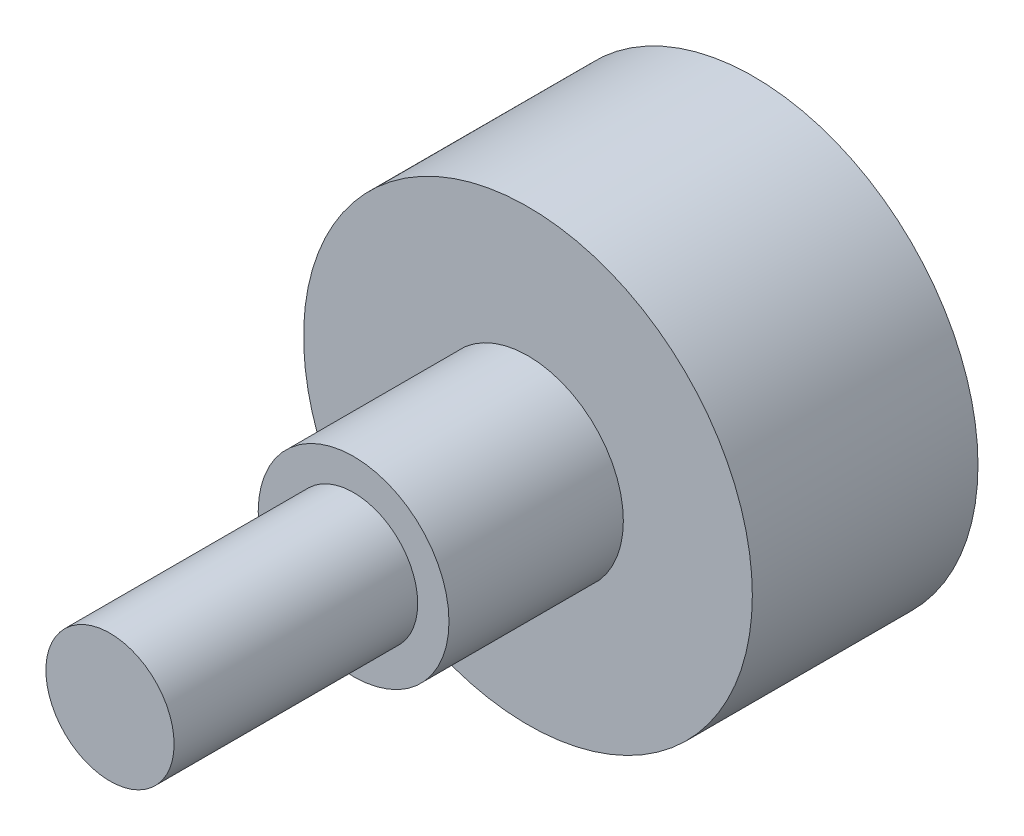
ISO-10303-21;
HEADER;
FILE_DESCRIPTION(('STEP AP214'),'2;1');
FILE_NAME('part.step','',(''),(''),'','','');
FILE_SCHEMA(('AUTOMOTIVE_DESIGN { 1 0 10303 214 1 1 1 1 }'));
ENDSEC;
DATA;
#1=APPLICATION_CONTEXT('core data for automotive mechanical design processes');
#2=APPLICATION_PROTOCOL_DEFINITION('international standard','automotive_design',2000,#1);
#3=PRODUCT_CONTEXT('',#1,'mechanical');
#4=PRODUCT('Part','Part','',(#3));
#5=PRODUCT_RELATED_PRODUCT_CATEGORY('part','',(#4));
#6=PRODUCT_DEFINITION_FORMATION('','',#4);
#7=PRODUCT_DEFINITION_CONTEXT('part definition',#1,'design');
#8=PRODUCT_DEFINITION('design','',#6,#7);
#9=PRODUCT_DEFINITION_SHAPE('','',#8);
#10=(LENGTH_UNIT() NAMED_UNIT(*) SI_UNIT(.MILLI.,.METRE.));
#11=(NAMED_UNIT(*) PLANE_ANGLE_UNIT() SI_UNIT($,.RADIAN.));
#12=(NAMED_UNIT(*) SI_UNIT($,.STERADIAN.) SOLID_ANGLE_UNIT());
#13=UNCERTAINTY_MEASURE_WITH_UNIT(LENGTH_MEASURE(1.E-05),#10,'distance_accuracy_value','');
#14=(GEOMETRIC_REPRESENTATION_CONTEXT(3) GLOBAL_UNCERTAINTY_ASSIGNED_CONTEXT((#13)) GLOBAL_UNIT_ASSIGNED_CONTEXT((#10,
#11,#12)) REPRESENTATION_CONTEXT('',''));
#15=CARTESIAN_POINT('',(0.,0.,0.));
#16=DIRECTION('',(0.,0.,1.));
#17=DIRECTION('',(1.,0.,0.));
#18=AXIS2_PLACEMENT_3D('',#15,#16,#17);
#19=CARTESIAN_POINT('',(0.,0.,11.176));
#20=DIRECTION('',(0.,0.,-1.));
#21=DIRECTION('',(-1.,0.,0.));
#22=AXIS2_PLACEMENT_3D('',#19,#20,#21);
#23=CYLINDRICAL_SURFACE('',#22,11.1125);
#24=CARTESIAN_POINT('',(0.,0.,11.176));
#25=DIRECTION('',(0.,0.,1.));
#26=DIRECTION('',(1.,0.,0.));
#27=AXIS2_PLACEMENT_3D('',#24,#25,#26);
#28=CIRCLE('',#27,11.1125);
#29=CARTESIAN_POINT('',(11.1125,0.,11.176));
#30=VERTEX_POINT('',#29);
#31=EDGE_CURVE('E10',#30,#30,#28,.T.);
#32=ORIENTED_EDGE('',*,*,#31,.F.);
#33=EDGE_LOOP('',(#32));
#34=FACE_BOUND('',#33,.T.);
#35=CARTESIAN_POINT('',(0.,0.,0.));
#36=DIRECTION('',(0.,0.,1.));
#37=DIRECTION('',(1.,0.,0.));
#38=AXIS2_PLACEMENT_3D('',#35,#36,#37);
#39=CIRCLE('',#38,11.1125);
#40=CARTESIAN_POINT('',(11.1125,0.,0.));
#41=VERTEX_POINT('',#40);
#42=EDGE_CURVE('E33',#41,#41,#39,.T.);
#43=ORIENTED_EDGE('',*,*,#42,.T.);
#44=EDGE_LOOP('',(#43));
#45=FACE_BOUND('',#44,.T.);
#46=ADVANCED_FACE('F30',(#34,#45),#23,.T.);
#47=CARTESIAN_POINT('',(0.,0.,11.176));
#48=DIRECTION('',(0.,0.,1.));
#49=DIRECTION('',(1.,0.,0.));
#50=AXIS2_PLACEMENT_3D('',#47,#48,#49);
#51=PLANE('',#50);
#52=CARTESIAN_POINT('',(0.,0.,11.176));
#53=DIRECTION('',(0.,0.,1.));
#54=DIRECTION('',(1.,0.,0.));
#55=AXIS2_PLACEMENT_3D('',#52,#53,#54);
#56=CIRCLE('',#55,4.7244);
#57=CARTESIAN_POINT('',(4.7244,0.,11.176));
#58=VERTEX_POINT('',#57);
#59=EDGE_CURVE('E42',#58,#58,#56,.T.);
#60=ORIENTED_EDGE('',*,*,#59,.F.);
#61=EDGE_LOOP('',(#60));
#62=FACE_BOUND('',#61,.T.);
#63=ORIENTED_EDGE('',*,*,#31,.T.);
#64=EDGE_LOOP('',(#63));
#65=FACE_BOUND('',#64,.T.);
#66=ADVANCED_FACE('F75',(#62,#65),#51,.T.);
#67=CARTESIAN_POINT('',(0.,0.,0.));
#68=DIRECTION('',(0.,0.,1.));
#69=DIRECTION('',(1.,0.,0.));
#70=AXIS2_PLACEMENT_3D('',#67,#68,#69);
#71=PLANE('',#70);
#72=ORIENTED_EDGE('',*,*,#42,.F.);
#73=EDGE_LOOP('',(#72));
#74=FACE_BOUND('',#73,.T.);
#75=ADVANCED_FACE('F71',(#74),#71,.F.);
#76=CARTESIAN_POINT('',(0.,0.,19.812));
#77=DIRECTION('',(0.,0.,-1.));
#78=DIRECTION('',(-1.,0.,0.));
#79=AXIS2_PLACEMENT_3D('',#76,#77,#78);
#80=CYLINDRICAL_SURFACE('',#79,4.7244);
#81=CARTESIAN_POINT('',(0.,0.,19.812));
#82=DIRECTION('',(0.,0.,1.));
#83=DIRECTION('',(1.,0.,0.));
#84=AXIS2_PLACEMENT_3D('',#81,#82,#83);
#85=CIRCLE('',#84,4.7244);
#86=CARTESIAN_POINT('',(4.7244,0.,19.812));
#87=VERTEX_POINT('',#86);
#88=EDGE_CURVE('E40',#87,#87,#85,.T.);
#89=ORIENTED_EDGE('',*,*,#88,.F.);
#90=EDGE_LOOP('',(#89));
#91=FACE_BOUND('',#90,.T.);
#92=ORIENTED_EDGE('',*,*,#59,.T.);
#93=EDGE_LOOP('',(#92));
#94=FACE_BOUND('',#93,.T.);
#95=ADVANCED_FACE('F65',(#91,#94),#80,.T.);
#96=CARTESIAN_POINT('',(0.,0.,19.812));
#97=DIRECTION('',(0.,0.,1.));
#98=DIRECTION('',(1.,0.,0.));
#99=AXIS2_PLACEMENT_3D('',#96,#97,#98);
#100=PLANE('',#99);
#101=CARTESIAN_POINT('',(0.,0.,19.812));
#102=DIRECTION('',(0.,0.,1.));
#103=DIRECTION('',(1.,0.,0.));
#104=AXIS2_PLACEMENT_3D('',#101,#102,#103);
#105=CIRCLE('',#104,3.175);
#106=CARTESIAN_POINT('',(3.175,0.,19.812));
#107=VERTEX_POINT('',#106);
#108=EDGE_CURVE('E48',#107,#107,#105,.T.);
#109=ORIENTED_EDGE('',*,*,#108,.F.);
#110=EDGE_LOOP('',(#109));
#111=FACE_BOUND('',#110,.T.);
#112=ORIENTED_EDGE('',*,*,#88,.T.);
#113=EDGE_LOOP('',(#112));
#114=FACE_BOUND('',#113,.T.);
#115=ADVANCED_FACE('F59',(#111,#114),#100,.T.);
#116=CARTESIAN_POINT('',(0.,0.,31.877));
#117=DIRECTION('',(0.,0.,-1.));
#118=DIRECTION('',(-1.,0.,0.));
#119=AXIS2_PLACEMENT_3D('',#116,#117,#118);
#120=CYLINDRICAL_SURFACE('',#119,3.175);
#121=CARTESIAN_POINT('',(0.,0.,31.877));
#122=DIRECTION('',(0.,0.,1.));
#123=DIRECTION('',(1.,0.,0.));
#124=AXIS2_PLACEMENT_3D('',#121,#122,#123);
#125=CIRCLE('',#124,3.175);
#126=CARTESIAN_POINT('',(3.175,0.,31.877));
#127=VERTEX_POINT('',#126);
#128=EDGE_CURVE('E45',#127,#127,#125,.T.);
#129=ORIENTED_EDGE('',*,*,#128,.F.);
#130=EDGE_LOOP('',(#129));
#131=FACE_BOUND('',#130,.T.);
#132=ORIENTED_EDGE('',*,*,#108,.T.);
#133=EDGE_LOOP('',(#132));
#134=FACE_BOUND('',#133,.T.);
#135=ADVANCED_FACE('F56',(#131,#134),#120,.T.);
#136=CARTESIAN_POINT('',(0.,0.,31.877));
#137=DIRECTION('',(0.,0.,1.));
#138=DIRECTION('',(1.,0.,0.));
#139=AXIS2_PLACEMENT_3D('',#136,#137,#138);
#140=PLANE('',#139);
#141=ORIENTED_EDGE('',*,*,#128,.T.);
#142=EDGE_LOOP('',(#141));
#143=FACE_BOUND('',#142,.T.);
#144=ADVANCED_FACE('F54',(#143),#140,.T.);
#145=CLOSED_SHELL('',(#46,#66,#75,#95,#115,#135,#144));
#146=MANIFOLD_SOLID_BREP('B2',#145);
#147=ADVANCED_BREP_SHAPE_REPRESENTATION('',(#18,#146),#14);
#148=SHAPE_DEFINITION_REPRESENTATION(#9,#147);
ENDSEC;
END-ISO-10303-21;
